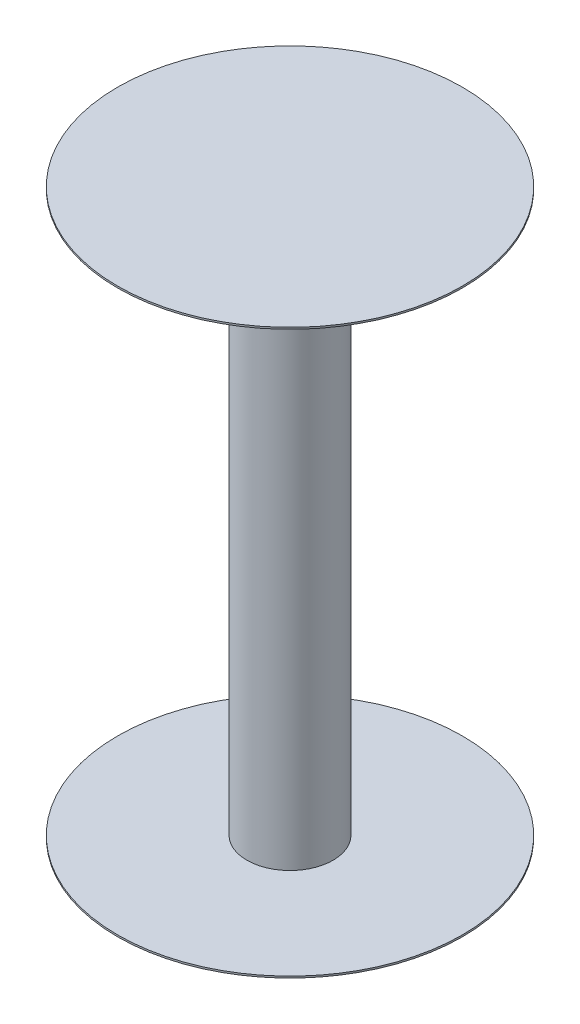
ISO-10303-21;
HEADER;
FILE_DESCRIPTION(('STEP AP214'),'2;1');
FILE_NAME('part.step','',(''),(''),'','','');
FILE_SCHEMA(('AUTOMOTIVE_DESIGN { 1 0 10303 214 1 1 1 1 }'));
ENDSEC;
DATA;
#1=APPLICATION_CONTEXT('core data for automotive mechanical design processes');
#2=APPLICATION_PROTOCOL_DEFINITION('international standard','automotive_design',2000,#1);
#3=PRODUCT_CONTEXT('',#1,'mechanical');
#4=PRODUCT('Part','Part','',(#3));
#5=PRODUCT_RELATED_PRODUCT_CATEGORY('part','',(#4));
#6=PRODUCT_DEFINITION_FORMATION('','',#4);
#7=PRODUCT_DEFINITION_CONTEXT('part definition',#1,'design');
#8=PRODUCT_DEFINITION('design','',#6,#7);
#9=PRODUCT_DEFINITION_SHAPE('','',#8);
#10=(LENGTH_UNIT() NAMED_UNIT(*) SI_UNIT(.MILLI.,.METRE.));
#11=(NAMED_UNIT(*) PLANE_ANGLE_UNIT() SI_UNIT($,.RADIAN.));
#12=(NAMED_UNIT(*) SI_UNIT($,.STERADIAN.) SOLID_ANGLE_UNIT());
#13=UNCERTAINTY_MEASURE_WITH_UNIT(LENGTH_MEASURE(1.E-05),#10,'distance_accuracy_value','');
#14=(GEOMETRIC_REPRESENTATION_CONTEXT(3) GLOBAL_UNCERTAINTY_ASSIGNED_CONTEXT((#13)) GLOBAL_UNIT_ASSIGNED_CONTEXT((#10,
#11,#12)) REPRESENTATION_CONTEXT('',''));
#15=CARTESIAN_POINT('',(0.,0.,0.));
#16=DIRECTION('',(0.,0.,1.));
#17=DIRECTION('',(1.,0.,0.));
#18=AXIS2_PLACEMENT_3D('',#15,#16,#17);
#19=CARTESIAN_POINT('',(0.,82.55,0.));
#20=DIRECTION('',(0.,-1.,0.));
#21=DIRECTION('',(0.,0.,-1.));
#22=AXIS2_PLACEMENT_3D('',#19,#20,#21);
#23=CYLINDRICAL_SURFACE('',#22,12.7);
#24=CARTESIAN_POINT('',(0.,82.55,0.));
#25=DIRECTION('',(0.,1.,0.));
#26=DIRECTION('',(0.,0.,1.));
#27=AXIS2_PLACEMENT_3D('',#24,#25,#26);
#28=CIRCLE('',#27,12.7);
#29=CARTESIAN_POINT('',(0.,82.55,12.7));
#30=VERTEX_POINT('',#29);
#31=EDGE_CURVE('E10',#30,#30,#28,.T.);
#32=ORIENTED_EDGE('',*,*,#31,.F.);
#33=EDGE_LOOP('',(#32));
#34=FACE_BOUND('',#33,.T.);
#35=CARTESIAN_POINT('',(0.,-82.55,0.));
#36=DIRECTION('',(0.,1.,0.));
#37=DIRECTION('',(0.,0.,1.));
#38=AXIS2_PLACEMENT_3D('',#35,#36,#37);
#39=CIRCLE('',#38,12.7);
#40=CARTESIAN_POINT('',(0.,-82.55,12.7));
#41=VERTEX_POINT('',#40);
#42=EDGE_CURVE('E40',#41,#41,#39,.T.);
#43=ORIENTED_EDGE('',*,*,#42,.T.);
#44=EDGE_LOOP('',(#43));
#45=FACE_BOUND('',#44,.T.);
#46=ADVANCED_FACE('F37',(#34,#45),#23,.T.);
#47=CARTESIAN_POINT('',(0.,83.058,0.));
#48=DIRECTION('',(0.,-1.,0.));
#49=DIRECTION('',(0.,0.,-1.));
#50=AXIS2_PLACEMENT_3D('',#47,#48,#49);
#51=CYLINDRICAL_SURFACE('',#50,50.8);
#52=CARTESIAN_POINT('',(0.,83.058,0.));
#53=DIRECTION('',(0.,1.,0.));
#54=DIRECTION('',(0.,0.,1.));
#55=AXIS2_PLACEMENT_3D('',#52,#53,#54);
#56=CIRCLE('',#55,50.8);
#57=CARTESIAN_POINT('',(0.,83.058,50.8));
#58=VERTEX_POINT('',#57);
#59=EDGE_CURVE('E45',#58,#58,#56,.T.);
#60=ORIENTED_EDGE('',*,*,#59,.F.);
#61=EDGE_LOOP('',(#60));
#62=FACE_BOUND('',#61,.T.);
#63=CARTESIAN_POINT('',(0.,82.55,0.));
#64=DIRECTION('',(0.,1.,0.));
#65=DIRECTION('',(0.,0.,1.));
#66=AXIS2_PLACEMENT_3D('',#63,#64,#65);
#67=CIRCLE('',#66,50.8);
#68=CARTESIAN_POINT('',(0.,82.55,50.8));
#69=VERTEX_POINT('',#68);
#70=EDGE_CURVE('E50',#69,#69,#67,.T.);
#71=ORIENTED_EDGE('',*,*,#70,.T.);
#72=EDGE_LOOP('',(#71));
#73=FACE_BOUND('',#72,.T.);
#74=ADVANCED_FACE('F91',(#62,#73),#51,.T.);
#75=CARTESIAN_POINT('',(0.,83.058,0.));
#76=DIRECTION('',(0.,1.,0.));
#77=DIRECTION('',(0.,0.,1.));
#78=AXIS2_PLACEMENT_3D('',#75,#76,#77);
#79=PLANE('',#78);
#80=ORIENTED_EDGE('',*,*,#59,.T.);
#81=EDGE_LOOP('',(#80));
#82=FACE_BOUND('',#81,.T.);
#83=ADVANCED_FACE('F87',(#82),#79,.T.);
#84=CARTESIAN_POINT('',(0.,82.55,0.));
#85=DIRECTION('',(0.,1.,0.));
#86=DIRECTION('',(0.,0.,1.));
#87=AXIS2_PLACEMENT_3D('',#84,#85,#86);
#88=PLANE('',#87);
#89=ORIENTED_EDGE('',*,*,#31,.T.);
#90=EDGE_LOOP('',(#89));
#91=FACE_BOUND('',#90,.T.);
#92=ORIENTED_EDGE('',*,*,#70,.F.);
#93=EDGE_LOOP('',(#92));
#94=FACE_BOUND('',#93,.T.);
#95=ADVANCED_FACE('F79',(#91,#94),#88,.F.);
#96=CARTESIAN_POINT('',(0.,-83.058,0.));
#97=DIRECTION('',(0.,1.,0.));
#98=DIRECTION('',(0.,0.,1.));
#99=AXIS2_PLACEMENT_3D('',#96,#97,#98);
#100=CYLINDRICAL_SURFACE('',#99,50.8);
#101=CARTESIAN_POINT('',(0.,-83.058,0.));
#102=DIRECTION('',(0.,1.,0.));
#103=DIRECTION('',(0.,0.,1.));
#104=AXIS2_PLACEMENT_3D('',#101,#102,#103);
#105=CIRCLE('',#104,50.8);
#106=CARTESIAN_POINT('',(0.,-83.058,50.8));
#107=VERTEX_POINT('',#106);
#108=EDGE_CURVE('E60',#107,#107,#105,.T.);
#109=ORIENTED_EDGE('',*,*,#108,.T.);
#110=EDGE_LOOP('',(#109));
#111=FACE_BOUND('',#110,.T.);
#112=CARTESIAN_POINT('',(0.,-82.55,0.));
#113=DIRECTION('',(0.,1.,0.));
#114=DIRECTION('',(0.,0.,1.));
#115=AXIS2_PLACEMENT_3D('',#112,#113,#114);
#116=CIRCLE('',#115,50.8);
#117=CARTESIAN_POINT('',(0.,-82.55,50.8));
#118=VERTEX_POINT('',#117);
#119=EDGE_CURVE('E56',#118,#118,#116,.T.);
#120=ORIENTED_EDGE('',*,*,#119,.F.);
#121=EDGE_LOOP('',(#120));
#122=FACE_BOUND('',#121,.T.);
#123=ADVANCED_FACE('F77',(#111,#122),#100,.T.);
#124=CARTESIAN_POINT('',(0.,-83.058,0.));
#125=DIRECTION('',(0.,-1.,0.));
#126=DIRECTION('',(0.,0.,1.));
#127=AXIS2_PLACEMENT_3D('',#124,#125,#126);
#128=PLANE('',#127);
#129=ORIENTED_EDGE('',*,*,#108,.F.);
#130=EDGE_LOOP('',(#129));
#131=FACE_BOUND('',#130,.T.);
#132=ADVANCED_FACE('F73',(#131),#128,.T.);
#133=CARTESIAN_POINT('',(0.,-82.55,0.));
#134=DIRECTION('',(0.,-1.,0.));
#135=DIRECTION('',(0.,0.,1.));
#136=AXIS2_PLACEMENT_3D('',#133,#134,#135);
#137=PLANE('',#136);
#138=ORIENTED_EDGE('',*,*,#42,.F.);
#139=EDGE_LOOP('',(#138));
#140=FACE_BOUND('',#139,.T.);
#141=ORIENTED_EDGE('',*,*,#119,.T.);
#142=EDGE_LOOP('',(#141));
#143=FACE_BOUND('',#142,.T.);
#144=ADVANCED_FACE('F70',(#140,#143),#137,.F.);
#145=CLOSED_SHELL('',(#46,#74,#83,#95,#123,#132,#144));
#146=MANIFOLD_SOLID_BREP('B2',#145);
#147=ADVANCED_BREP_SHAPE_REPRESENTATION('',(#18,#146),#14);
#148=SHAPE_DEFINITION_REPRESENTATION(#9,#147);
ENDSEC;
END-ISO-10303-21;
